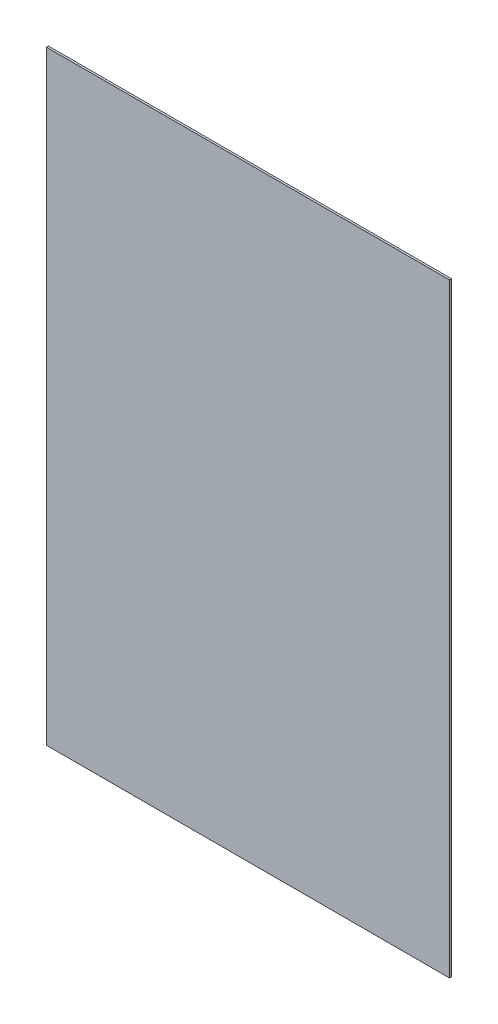
ISO-10303-21;
HEADER;
FILE_DESCRIPTION(('STEP AP214'),'2;1');
FILE_NAME('part.step','',(''),(''),'','','');
FILE_SCHEMA(('AUTOMOTIVE_DESIGN { 1 0 10303 214 1 1 1 1 }'));
ENDSEC;
DATA;
#1=APPLICATION_CONTEXT('core data for automotive mechanical design processes');
#2=APPLICATION_PROTOCOL_DEFINITION('international standard','automotive_design',2000,#1);
#3=PRODUCT_CONTEXT('',#1,'mechanical');
#4=PRODUCT('Part','Part','',(#3));
#5=PRODUCT_RELATED_PRODUCT_CATEGORY('part','',(#4));
#6=PRODUCT_DEFINITION_FORMATION('','',#4);
#7=PRODUCT_DEFINITION_CONTEXT('part definition',#1,'design');
#8=PRODUCT_DEFINITION('design','',#6,#7);
#9=PRODUCT_DEFINITION_SHAPE('','',#8);
#10=(LENGTH_UNIT() NAMED_UNIT(*) SI_UNIT(.MILLI.,.METRE.));
#11=(NAMED_UNIT(*) PLANE_ANGLE_UNIT() SI_UNIT($,.RADIAN.));
#12=(NAMED_UNIT(*) SI_UNIT($,.STERADIAN.) SOLID_ANGLE_UNIT());
#13=UNCERTAINTY_MEASURE_WITH_UNIT(LENGTH_MEASURE(1.E-05),#10,'distance_accuracy_value','');
#14=(GEOMETRIC_REPRESENTATION_CONTEXT(3) GLOBAL_UNCERTAINTY_ASSIGNED_CONTEXT((#13)) GLOBAL_UNIT_ASSIGNED_CONTEXT((#10,
#11,#12)) REPRESENTATION_CONTEXT('',''));
#15=CARTESIAN_POINT('',(0.,0.,0.));
#16=DIRECTION('',(0.,0.,1.));
#17=DIRECTION('',(1.,0.,0.));
#18=AXIS2_PLACEMENT_3D('',#15,#16,#17);
#19=CARTESIAN_POINT('',(0.,0.,10.));
#20=DIRECTION('',(1.,0.,0.));
#21=DIRECTION('',(0.,0.,-1.));
#22=AXIS2_PLACEMENT_3D('',#19,#20,#21);
#23=PLANE('',#22);
#24=DIRECTION('',(0.,-1.,0.));
#25=VECTOR('',#24,1.);
#26=CARTESIAN_POINT('',(0.,0.,0.));
#27=LINE('',#26,#25);
#28=CARTESIAN_POINT('',(0.,3000.,0.));
#29=VERTEX_POINT('',#28);
#30=CARTESIAN_POINT('',(0.,0.,0.));
#31=VERTEX_POINT('',#30);
#32=EDGE_CURVE('E94',#29,#31,#27,.T.);
#33=ORIENTED_EDGE('',*,*,#32,.T.);
#34=DIRECTION('',(0.,0.,-1.));
#35=VECTOR('',#34,1.);
#36=CARTESIAN_POINT('',(0.,0.,10.));
#37=LINE('',#36,#35);
#38=CARTESIAN_POINT('',(0.,0.,10.));
#39=VERTEX_POINT('',#38);
#40=EDGE_CURVE('E11',#39,#31,#37,.T.);
#41=ORIENTED_EDGE('',*,*,#40,.F.);
#42=DIRECTION('',(0.,-1.,0.));
#43=VECTOR('',#42,1.);
#44=CARTESIAN_POINT('',(0.,0.,10.));
#45=LINE('',#44,#43);
#46=CARTESIAN_POINT('',(0.,3000.,10.));
#47=VERTEX_POINT('',#46);
#48=EDGE_CURVE('E82',#47,#39,#45,.T.);
#49=ORIENTED_EDGE('',*,*,#48,.F.);
#50=DIRECTION('',(0.,0.,-1.));
#51=VECTOR('',#50,1.);
#52=CARTESIAN_POINT('',(0.,3000.,10.));
#53=LINE('',#52,#51);
#54=EDGE_CURVE('E90',#47,#29,#53,.T.);
#55=ORIENTED_EDGE('',*,*,#54,.T.);
#56=EDGE_LOOP('',(#33,#41,#49,#55));
#57=FACE_BOUND('',#56,.T.);
#58=ADVANCED_FACE('F31',(#57),#23,.F.);
#59=CARTESIAN_POINT('',(0.,0.,10.));
#60=DIRECTION('',(0.,1.,0.));
#61=DIRECTION('',(0.,0.,1.));
#62=AXIS2_PLACEMENT_3D('',#59,#60,#61);
#63=PLANE('',#62);
#64=DIRECTION('',(1.,0.,0.));
#65=VECTOR('',#64,1.);
#66=CARTESIAN_POINT('',(0.,0.,0.));
#67=LINE('',#66,#65);
#68=CARTESIAN_POINT('',(2000.,0.,0.));
#69=VERTEX_POINT('',#68);
#70=EDGE_CURVE('E86',#31,#69,#67,.T.);
#71=ORIENTED_EDGE('',*,*,#70,.T.);
#72=DIRECTION('',(0.,0.,-1.));
#73=VECTOR('',#72,1.);
#74=CARTESIAN_POINT('',(2000.,0.,10.));
#75=LINE('',#74,#73);
#76=CARTESIAN_POINT('',(2000.,0.,10.));
#77=VERTEX_POINT('',#76);
#78=EDGE_CURVE('E39',#77,#69,#75,.T.);
#79=ORIENTED_EDGE('',*,*,#78,.F.);
#80=DIRECTION('',(1.,0.,0.));
#81=VECTOR('',#80,1.);
#82=CARTESIAN_POINT('',(0.,0.,10.));
#83=LINE('',#82,#81);
#84=EDGE_CURVE('E77',#39,#77,#83,.T.);
#85=ORIENTED_EDGE('',*,*,#84,.F.);
#86=ORIENTED_EDGE('',*,*,#40,.T.);
#87=EDGE_LOOP('',(#71,#79,#85,#86));
#88=FACE_BOUND('',#87,.T.);
#89=ADVANCED_FACE('F85',(#88),#63,.F.);
#90=CARTESIAN_POINT('',(2000.,0.,10.));
#91=DIRECTION('',(-1.,0.,0.));
#92=DIRECTION('',(0.,0.,1.));
#93=AXIS2_PLACEMENT_3D('',#90,#91,#92);
#94=PLANE('',#93);
#95=DIRECTION('',(0.,1.,0.));
#96=VECTOR('',#95,1.);
#97=CARTESIAN_POINT('',(2000.,0.,0.));
#98=LINE('',#97,#96);
#99=CARTESIAN_POINT('',(2000.,3000.,0.));
#100=VERTEX_POINT('',#99);
#101=EDGE_CURVE('E64',#69,#100,#98,.T.);
#102=ORIENTED_EDGE('',*,*,#101,.T.);
#103=DIRECTION('',(0.,0.,-1.));
#104=VECTOR('',#103,1.);
#105=CARTESIAN_POINT('',(2000.,3000.,10.));
#106=LINE('',#105,#104);
#107=CARTESIAN_POINT('',(2000.,3000.,10.));
#108=VERTEX_POINT('',#107);
#109=EDGE_CURVE('E87',#108,#100,#106,.T.);
#110=ORIENTED_EDGE('',*,*,#109,.F.);
#111=DIRECTION('',(0.,1.,0.));
#112=VECTOR('',#111,1.);
#113=CARTESIAN_POINT('',(2000.,0.,10.));
#114=LINE('',#113,#112);
#115=EDGE_CURVE('E80',#77,#108,#114,.T.);
#116=ORIENTED_EDGE('',*,*,#115,.F.);
#117=ORIENTED_EDGE('',*,*,#78,.T.);
#118=EDGE_LOOP('',(#102,#110,#116,#117));
#119=FACE_BOUND('',#118,.T.);
#120=ADVANCED_FACE('F88',(#119),#94,.F.);
#121=CARTESIAN_POINT('',(0.,3000.,10.));
#122=DIRECTION('',(0.,-1.,0.));
#123=DIRECTION('',(0.,0.,-1.));
#124=AXIS2_PLACEMENT_3D('',#121,#122,#123);
#125=PLANE('',#124);
#126=DIRECTION('',(-1.,0.,0.));
#127=VECTOR('',#126,1.);
#128=CARTESIAN_POINT('',(0.,3000.,0.));
#129=LINE('',#128,#127);
#130=EDGE_CURVE('E70',#100,#29,#129,.T.);
#131=ORIENTED_EDGE('',*,*,#130,.T.);
#132=ORIENTED_EDGE('',*,*,#54,.F.);
#133=DIRECTION('',(-1.,0.,0.));
#134=VECTOR('',#133,1.);
#135=CARTESIAN_POINT('',(0.,3000.,10.));
#136=LINE('',#135,#134);
#137=EDGE_CURVE('E47',#108,#47,#136,.T.);
#138=ORIENTED_EDGE('',*,*,#137,.F.);
#139=ORIENTED_EDGE('',*,*,#109,.T.);
#140=EDGE_LOOP('',(#131,#132,#138,#139));
#141=FACE_BOUND('',#140,.T.);
#142=ADVANCED_FACE('F101',(#141),#125,.F.);
#143=CARTESIAN_POINT('',(0.,3000.,10.));
#144=DIRECTION('',(0.,0.,-1.));
#145=DIRECTION('',(-1.,0.,0.));
#146=AXIS2_PLACEMENT_3D('',#143,#144,#145);
#147=PLANE('',#146);
#148=ORIENTED_EDGE('',*,*,#48,.T.);
#149=ORIENTED_EDGE('',*,*,#84,.T.);
#150=ORIENTED_EDGE('',*,*,#115,.T.);
#151=ORIENTED_EDGE('',*,*,#137,.T.);
#152=EDGE_LOOP('',(#148,#149,#150,#151));
#153=FACE_BOUND('',#152,.T.);
#154=ADVANCED_FACE('F78',(#153),#147,.F.);
#155=CARTESIAN_POINT('',(0.,3000.,0.));
#156=DIRECTION('',(0.,0.,-1.));
#157=DIRECTION('',(-1.,0.,0.));
#158=AXIS2_PLACEMENT_3D('',#155,#156,#157);
#159=PLANE('',#158);
#160=ORIENTED_EDGE('',*,*,#32,.F.);
#161=ORIENTED_EDGE('',*,*,#130,.F.);
#162=ORIENTED_EDGE('',*,*,#101,.F.);
#163=ORIENTED_EDGE('',*,*,#70,.F.);
#164=EDGE_LOOP('',(#160,#161,#162,#163));
#165=FACE_BOUND('',#164,.T.);
#166=ADVANCED_FACE('F104',(#165),#159,.T.);
#167=CLOSED_SHELL('',(#58,#89,#120,#142,#154,#166));
#168=MANIFOLD_SOLID_BREP('B2',#167);
#169=ADVANCED_BREP_SHAPE_REPRESENTATION('',(#18,#168),#14);
#170=SHAPE_DEFINITION_REPRESENTATION(#9,#169);
ENDSEC;
END-ISO-10303-21;
